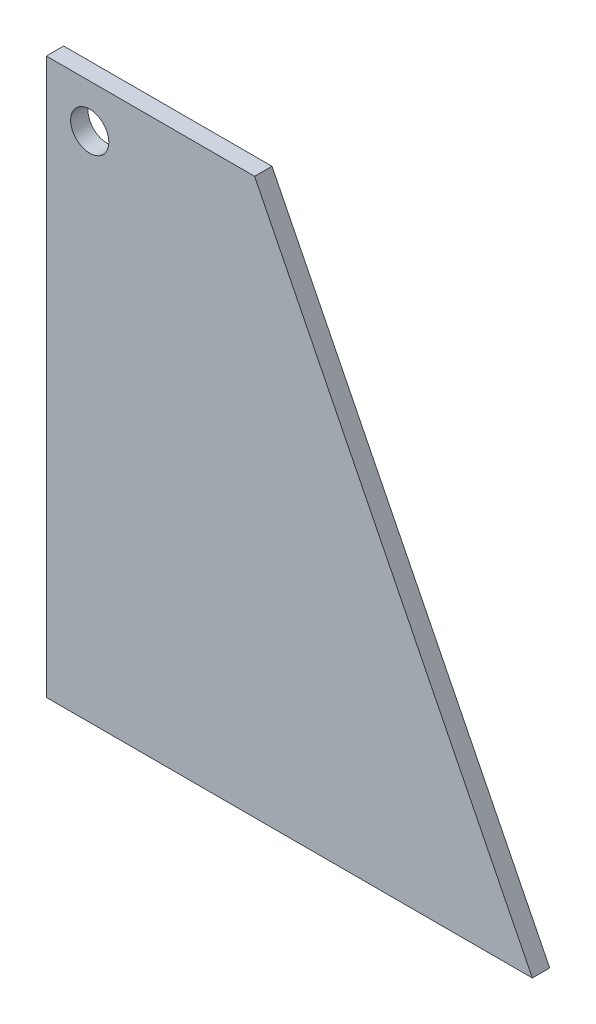
ISO-10303-21;
HEADER;
FILE_DESCRIPTION(('STEP AP214'),'2;1');
FILE_NAME('part.step','',(''),(''),'','','');
FILE_SCHEMA(('AUTOMOTIVE_DESIGN { 1 0 10303 214 1 1 1 1 }'));
ENDSEC;
DATA;
#1=APPLICATION_CONTEXT('core data for automotive mechanical design processes');
#2=APPLICATION_PROTOCOL_DEFINITION('international standard','automotive_design',2000,#1);
#3=PRODUCT_CONTEXT('',#1,'mechanical');
#4=PRODUCT('Part','Part','',(#3));
#5=PRODUCT_RELATED_PRODUCT_CATEGORY('part','',(#4));
#6=PRODUCT_DEFINITION_FORMATION('','',#4);
#7=PRODUCT_DEFINITION_CONTEXT('part definition',#1,'design');
#8=PRODUCT_DEFINITION('design','',#6,#7);
#9=PRODUCT_DEFINITION_SHAPE('','',#8);
#10=(LENGTH_UNIT() NAMED_UNIT(*) SI_UNIT(.MILLI.,.METRE.));
#11=(NAMED_UNIT(*) PLANE_ANGLE_UNIT() SI_UNIT($,.RADIAN.));
#12=(NAMED_UNIT(*) SI_UNIT($,.STERADIAN.) SOLID_ANGLE_UNIT());
#13=UNCERTAINTY_MEASURE_WITH_UNIT(LENGTH_MEASURE(1.E-05),#10,'distance_accuracy_value','');
#14=(GEOMETRIC_REPRESENTATION_CONTEXT(3) GLOBAL_UNCERTAINTY_ASSIGNED_CONTEXT((#13)) GLOBAL_UNIT_ASSIGNED_CONTEXT((#10,
#11,#12)) REPRESENTATION_CONTEXT('',''));
#15=CARTESIAN_POINT('',(0.,0.,0.));
#16=DIRECTION('',(0.,0.,1.));
#17=DIRECTION('',(1.,0.,0.));
#18=AXIS2_PLACEMENT_3D('',#15,#16,#17);
#19=CARTESIAN_POINT('',(0.,0.,3.175));
#20=DIRECTION('',(0.,0.,1.));
#21=DIRECTION('',(1.,0.,0.));
#22=AXIS2_PLACEMENT_3D('',#19,#20,#21);
#23=PLANE('',#22);
#24=DIRECTION('',(-0.447213595499958,0.894427190999916,0.));
#25=VECTOR('',#24,1.);
#26=CARTESIAN_POINT('',(-12.7,101.6,3.175));
#27=LINE('',#26,#25);
#28=CARTESIAN_POINT('',(88.9,-101.6,3.175));
#29=VERTEX_POINT('',#28);
#30=CARTESIAN_POINT('',(-12.7,101.6,3.175));
#31=VERTEX_POINT('',#30);
#32=EDGE_CURVE('E85',#29,#31,#27,.T.);
#33=ORIENTED_EDGE('',*,*,#32,.T.);
#34=DIRECTION('',(-1.,0.,0.));
#35=VECTOR('',#34,1.);
#36=CARTESIAN_POINT('',(-88.9,101.6,3.175));
#37=LINE('',#36,#35);
#38=CARTESIAN_POINT('',(-88.9,101.6,3.175));
#39=VERTEX_POINT('',#38);
#40=EDGE_CURVE('E80',#31,#39,#37,.T.);
#41=ORIENTED_EDGE('',*,*,#40,.T.);
#42=DIRECTION('',(0.,-1.,0.));
#43=VECTOR('',#42,1.);
#44=CARTESIAN_POINT('',(-88.9,101.6,3.175));
#45=LINE('',#44,#43);
#46=CARTESIAN_POINT('',(-88.9,-101.6,3.175));
#47=VERTEX_POINT('',#46);
#48=EDGE_CURVE('E83',#39,#47,#45,.T.);
#49=ORIENTED_EDGE('',*,*,#48,.T.);
#50=DIRECTION('',(1.,0.,0.));
#51=VECTOR('',#50,1.);
#52=CARTESIAN_POINT('',(-88.9,-101.6,3.175));
#53=LINE('',#52,#51);
#54=EDGE_CURVE('E50',#47,#29,#53,.T.);
#55=ORIENTED_EDGE('',*,*,#54,.T.);
#56=EDGE_LOOP('',(#33,#41,#49,#55));
#57=FACE_BOUND('',#56,.T.);
#58=CARTESIAN_POINT('',(-73.025,85.725,3.175));
#59=DIRECTION('',(0.,0.,1.));
#60=DIRECTION('',(1.,0.,0.));
#61=AXIS2_PLACEMENT_3D('',#58,#59,#60);
#62=CIRCLE('',#61,6.985);
#63=CARTESIAN_POINT('',(-66.04,85.725,3.175));
#64=VERTEX_POINT('',#63);
#65=EDGE_CURVE('E100',#64,#64,#62,.T.);
#66=ORIENTED_EDGE('',*,*,#65,.F.);
#67=EDGE_LOOP('',(#66));
#68=FACE_BOUND('',#67,.T.);
#69=ADVANCED_FACE('F33',(#57,#68),#23,.T.);
#70=CARTESIAN_POINT('',(0.,0.,-3.175));
#71=DIRECTION('',(0.,0.,1.));
#72=DIRECTION('',(1.,0.,0.));
#73=AXIS2_PLACEMENT_3D('',#70,#71,#72);
#74=PLANE('',#73);
#75=DIRECTION('',(-0.447213595499958,0.894427190999916,0.));
#76=VECTOR('',#75,1.);
#77=CARTESIAN_POINT('',(-12.7,101.6,-3.175));
#78=LINE('',#77,#76);
#79=CARTESIAN_POINT('',(88.9,-101.6,-3.175));
#80=VERTEX_POINT('',#79);
#81=CARTESIAN_POINT('',(-12.7,101.6,-3.175));
#82=VERTEX_POINT('',#81);
#83=EDGE_CURVE('E97',#80,#82,#78,.T.);
#84=ORIENTED_EDGE('',*,*,#83,.F.);
#85=DIRECTION('',(1.,0.,0.));
#86=VECTOR('',#85,1.);
#87=CARTESIAN_POINT('',(-88.9,-101.6,-3.175));
#88=LINE('',#87,#86);
#89=CARTESIAN_POINT('',(-88.9,-101.6,-3.175));
#90=VERTEX_POINT('',#89);
#91=EDGE_CURVE('E73',#90,#80,#88,.T.);
#92=ORIENTED_EDGE('',*,*,#91,.F.);
#93=DIRECTION('',(0.,-1.,0.));
#94=VECTOR('',#93,1.);
#95=CARTESIAN_POINT('',(-88.9,101.6,-3.175));
#96=LINE('',#95,#94);
#97=CARTESIAN_POINT('',(-88.9,101.6,-3.175));
#98=VERTEX_POINT('',#97);
#99=EDGE_CURVE('E67',#98,#90,#96,.T.);
#100=ORIENTED_EDGE('',*,*,#99,.F.);
#101=DIRECTION('',(-1.,0.,0.));
#102=VECTOR('',#101,1.);
#103=CARTESIAN_POINT('',(-88.9,101.6,-3.175));
#104=LINE('',#103,#102);
#105=EDGE_CURVE('E89',#82,#98,#104,.T.);
#106=ORIENTED_EDGE('',*,*,#105,.F.);
#107=EDGE_LOOP('',(#84,#92,#100,#106));
#108=FACE_BOUND('',#107,.T.);
#109=CARTESIAN_POINT('',(-73.025,85.725,-3.175));
#110=DIRECTION('',(0.,0.,1.));
#111=DIRECTION('',(1.,0.,0.));
#112=AXIS2_PLACEMENT_3D('',#109,#110,#111);
#113=CIRCLE('',#112,6.985);
#114=CARTESIAN_POINT('',(-66.04,85.725,-3.175));
#115=VERTEX_POINT('',#114);
#116=EDGE_CURVE('E112',#115,#115,#113,.T.);
#117=ORIENTED_EDGE('',*,*,#116,.T.);
#118=EDGE_LOOP('',(#117));
#119=FACE_BOUND('',#118,.T.);
#120=ADVANCED_FACE('F108',(#108,#119),#74,.F.);
#121=CARTESIAN_POINT('',(-12.7,101.6,3.175));
#122=DIRECTION('',(-0.894427190999916,-0.447213595499958,0.));
#123=DIRECTION('',(0.447213595499958,-0.894427190999916,0.));
#124=AXIS2_PLACEMENT_3D('',#121,#122,#123);
#125=PLANE('',#124);
#126=ORIENTED_EDGE('',*,*,#83,.T.);
#127=DIRECTION('',(0.,0.,-1.));
#128=VECTOR('',#127,1.);
#129=CARTESIAN_POINT('',(-12.7,101.6,3.175));
#130=LINE('',#129,#128);
#131=EDGE_CURVE('E11',#31,#82,#130,.T.);
#132=ORIENTED_EDGE('',*,*,#131,.F.);
#133=ORIENTED_EDGE('',*,*,#32,.F.);
#134=DIRECTION('',(0.,0.,-1.));
#135=VECTOR('',#134,1.);
#136=CARTESIAN_POINT('',(88.9,-101.6,3.175));
#137=LINE('',#136,#135);
#138=EDGE_CURVE('E93',#29,#80,#137,.T.);
#139=ORIENTED_EDGE('',*,*,#138,.T.);
#140=EDGE_LOOP('',(#126,#132,#133,#139));
#141=FACE_BOUND('',#140,.T.);
#142=ADVANCED_FACE('F35',(#141),#125,.F.);
#143=CARTESIAN_POINT('',(-88.9,101.6,3.175));
#144=DIRECTION('',(0.,-1.,0.));
#145=DIRECTION('',(0.,0.,-1.));
#146=AXIS2_PLACEMENT_3D('',#143,#144,#145);
#147=PLANE('',#146);
#148=ORIENTED_EDGE('',*,*,#105,.T.);
#149=DIRECTION('',(0.,0.,-1.));
#150=VECTOR('',#149,1.);
#151=CARTESIAN_POINT('',(-88.9,101.6,3.175));
#152=LINE('',#151,#150);
#153=EDGE_CURVE('E42',#39,#98,#152,.T.);
#154=ORIENTED_EDGE('',*,*,#153,.F.);
#155=ORIENTED_EDGE('',*,*,#40,.F.);
#156=ORIENTED_EDGE('',*,*,#131,.T.);
#157=EDGE_LOOP('',(#148,#154,#155,#156));
#158=FACE_BOUND('',#157,.T.);
#159=ADVANCED_FACE('F88',(#158),#147,.F.);
#160=CARTESIAN_POINT('',(-88.9,101.6,3.175));
#161=DIRECTION('',(1.,0.,0.));
#162=DIRECTION('',(0.,1.,0.));
#163=AXIS2_PLACEMENT_3D('',#160,#161,#162);
#164=PLANE('',#163);
#165=ORIENTED_EDGE('',*,*,#99,.T.);
#166=DIRECTION('',(0.,0.,-1.));
#167=VECTOR('',#166,1.);
#168=CARTESIAN_POINT('',(-88.9,-101.6,3.175));
#169=LINE('',#168,#167);
#170=EDGE_CURVE('E90',#47,#90,#169,.T.);
#171=ORIENTED_EDGE('',*,*,#170,.F.);
#172=ORIENTED_EDGE('',*,*,#48,.F.);
#173=ORIENTED_EDGE('',*,*,#153,.T.);
#174=EDGE_LOOP('',(#165,#171,#172,#173));
#175=FACE_BOUND('',#174,.T.);
#176=ADVANCED_FACE('F91',(#175),#164,.F.);
#177=CARTESIAN_POINT('',(-88.9,-101.6,3.175));
#178=DIRECTION('',(0.,1.,0.));
#179=DIRECTION('',(0.,0.,1.));
#180=AXIS2_PLACEMENT_3D('',#177,#178,#179);
#181=PLANE('',#180);
#182=ORIENTED_EDGE('',*,*,#91,.T.);
#183=ORIENTED_EDGE('',*,*,#138,.F.);
#184=ORIENTED_EDGE('',*,*,#54,.F.);
#185=ORIENTED_EDGE('',*,*,#170,.T.);
#186=EDGE_LOOP('',(#182,#183,#184,#185));
#187=FACE_BOUND('',#186,.T.);
#188=ADVANCED_FACE('F105',(#187),#181,.F.);
#189=CARTESIAN_POINT('',(-73.025,85.725,3.175));
#190=DIRECTION('',(0.,0.,-1.));
#191=DIRECTION('',(-1.,0.,0.));
#192=AXIS2_PLACEMENT_3D('',#189,#190,#191);
#193=CYLINDRICAL_SURFACE('',#192,6.985);
#194=ORIENTED_EDGE('',*,*,#65,.T.);
#195=EDGE_LOOP('',(#194));
#196=FACE_BOUND('',#195,.T.);
#197=ORIENTED_EDGE('',*,*,#116,.F.);
#198=EDGE_LOOP('',(#197));
#199=FACE_BOUND('',#198,.T.);
#200=ADVANCED_FACE('F118',(#196,#199),#193,.F.);
#201=CLOSED_SHELL('',(#69,#120,#142,#159,#176,#188,#200));
#202=MANIFOLD_SOLID_BREP('B2',#201);
#203=ADVANCED_BREP_SHAPE_REPRESENTATION('',(#18,#202),#14);
#204=SHAPE_DEFINITION_REPRESENTATION(#9,#203);
ENDSEC;
END-ISO-10303-21;
